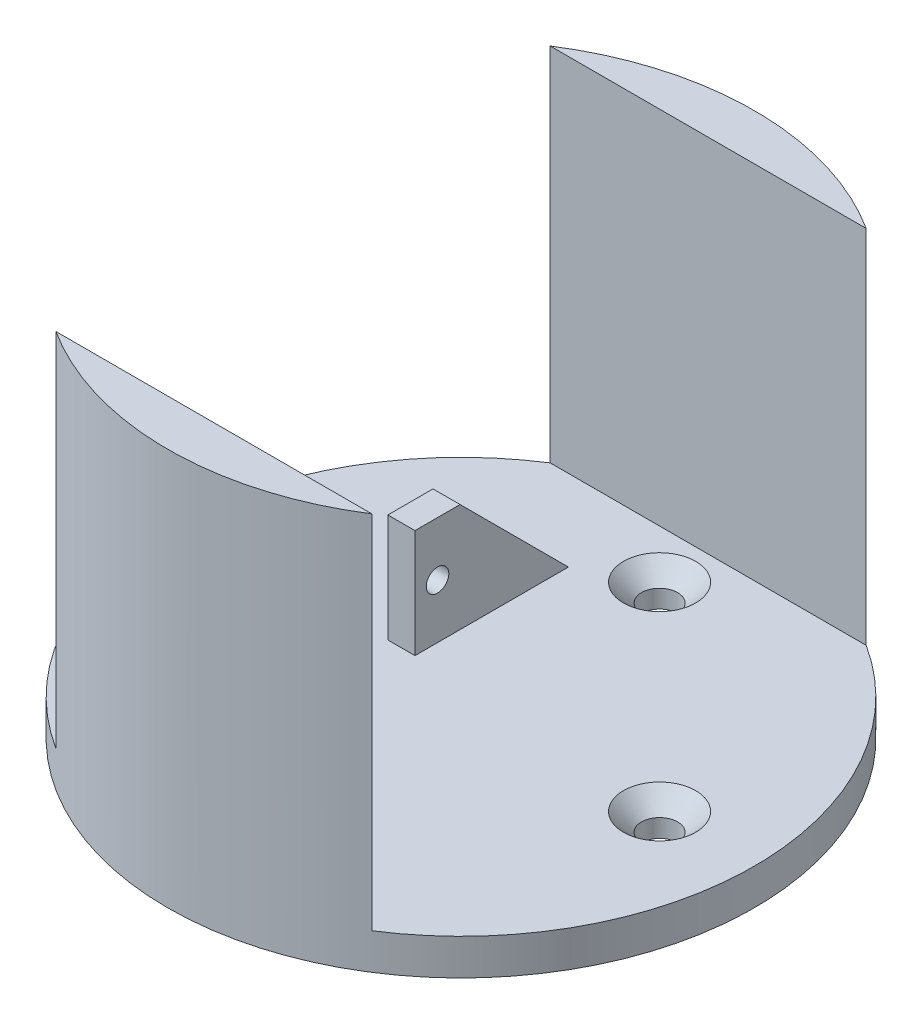
ISO-10303-21;
HEADER;
FILE_DESCRIPTION(('STEP AP214'),'2;1');
FILE_NAME('part.step','',(''),(''),'','','');
FILE_SCHEMA(('AUTOMOTIVE_DESIGN { 1 0 10303 214 1 1 1 1 }'));
ENDSEC;
DATA;
#1=APPLICATION_CONTEXT('core data for automotive mechanical design processes');
#2=APPLICATION_PROTOCOL_DEFINITION('international standard','automotive_design',2000,#1);
#3=PRODUCT_CONTEXT('',#1,'mechanical');
#4=PRODUCT('Part','Part','',(#3));
#5=PRODUCT_RELATED_PRODUCT_CATEGORY('part','',(#4));
#6=PRODUCT_DEFINITION_FORMATION('','',#4);
#7=PRODUCT_DEFINITION_CONTEXT('part definition',#1,'design');
#8=PRODUCT_DEFINITION('design','',#6,#7);
#9=PRODUCT_DEFINITION_SHAPE('','',#8);
#10=(LENGTH_UNIT() NAMED_UNIT(*) SI_UNIT(.MILLI.,.METRE.));
#11=(NAMED_UNIT(*) PLANE_ANGLE_UNIT() SI_UNIT($,.RADIAN.));
#12=(NAMED_UNIT(*) SI_UNIT($,.STERADIAN.) SOLID_ANGLE_UNIT());
#13=UNCERTAINTY_MEASURE_WITH_UNIT(LENGTH_MEASURE(1.E-05),#10,'distance_accuracy_value','');
#14=(GEOMETRIC_REPRESENTATION_CONTEXT(3) GLOBAL_UNCERTAINTY_ASSIGNED_CONTEXT((#13)) GLOBAL_UNIT_ASSIGNED_CONTEXT((#10,
#11,#12)) REPRESENTATION_CONTEXT('',''));
#15=CARTESIAN_POINT('',(0.,0.,0.));
#16=DIRECTION('',(0.,0.,1.));
#17=DIRECTION('',(1.,0.,0.));
#18=AXIS2_PLACEMENT_3D('',#15,#16,#17);
#19=CARTESIAN_POINT('',(0.,4.,0.));
#20=DIRECTION('',(0.,1.,0.));
#21=DIRECTION('',(0.,0.,1.));
#22=AXIS2_PLACEMENT_3D('',#19,#20,#21);
#23=PLANE('',#22);
#24=CARTESIAN_POINT('',(-28.95,4.,-1.9));
#25=DIRECTION('',(0.,1.,0.));
#26=DIRECTION('',(0.,0.,-1.));
#27=AXIS2_PLACEMENT_3D('',#24,#25,#26);
#28=CIRCLE('',#27,2.);
#29=CARTESIAN_POINT('',(-26.95,4.,-1.9));
#30=VERTEX_POINT('',#29);
#31=CARTESIAN_POINT('',(-30.95,4.,-1.9));
#32=VERTEX_POINT('',#31);
#33=EDGE_CURVE('E160',#30,#32,#28,.T.);
#34=ORIENTED_EDGE('',*,*,#33,.F.);
#35=DIRECTION('',(0.,0.,-1.));
#36=VECTOR('',#35,1.);
#37=CARTESIAN_POINT('',(-26.95,4.,-1.9));
#38=LINE('',#37,#36);
#39=CARTESIAN_POINT('',(-26.95,4.,3.1));
#40=VERTEX_POINT('',#39);
#41=EDGE_CURVE('E177',#40,#30,#38,.T.);
#42=ORIENTED_EDGE('',*,*,#41,.F.);
#43=CARTESIAN_POINT('',(-28.95,4.,3.1));
#44=DIRECTION('',(0.,1.,0.));
#45=DIRECTION('',(0.,0.,1.));
#46=AXIS2_PLACEMENT_3D('',#43,#44,#45);
#47=CIRCLE('',#46,2.);
#48=CARTESIAN_POINT('',(-30.95,4.,3.1));
#49=VERTEX_POINT('',#48);
#50=EDGE_CURVE('E180',#49,#40,#47,.T.);
#51=ORIENTED_EDGE('',*,*,#50,.F.);
#52=DIRECTION('',(0.,0.,1.));
#53=VECTOR('',#52,1.);
#54=CARTESIAN_POINT('',(-30.95,4.,-1.9));
#55=LINE('',#54,#53);
#56=EDGE_CURVE('E186',#32,#49,#55,.T.);
#57=ORIENTED_EDGE('',*,*,#56,.F.);
#58=EDGE_LOOP('',(#34,#42,#51,#57));
#59=FACE_BOUND('',#58,.T.);
#60=CARTESIAN_POINT('',(-2.30437768363647E-13,4.,22.));
#61=DIRECTION('',(0.,1.,0.));
#62=DIRECTION('',(0.,0.,1.));
#63=AXIS2_PLACEMENT_3D('',#60,#61,#62);
#64=CIRCLE('',#63,4.00000000000003);
#65=CARTESIAN_POINT('',(-2.30437768363647E-13,4.,26.));
#66=VERTEX_POINT('',#65);
#67=EDGE_CURVE('E309',#66,#66,#64,.F.);
#68=ORIENTED_EDGE('',*,*,#67,.T.);
#69=EDGE_LOOP('',(#68));
#70=FACE_BOUND('',#69,.T.);
#71=CARTESIAN_POINT('',(0.,4.,-22.));
#72=DIRECTION('',(0.,1.,0.));
#73=DIRECTION('',(0.,0.,1.));
#74=AXIS2_PLACEMENT_3D('',#71,#72,#73);
#75=CIRCLE('',#74,4.00000000000003);
#76=CARTESIAN_POINT('',(0.,4.,-18.));
#77=VERTEX_POINT('',#76);
#78=EDGE_CURVE('E306',#77,#77,#75,.F.);
#79=ORIENTED_EDGE('',*,*,#78,.T.);
#80=EDGE_LOOP('',(#79));
#81=FACE_BOUND('',#80,.T.);
#82=CARTESIAN_POINT('',(22.,4.,1.53625178909098E-13));
#83=DIRECTION('',(0.,1.,0.));
#84=DIRECTION('',(0.,0.,1.));
#85=AXIS2_PLACEMENT_3D('',#82,#83,#84);
#86=CIRCLE('',#85,4.00000000000003);
#87=CARTESIAN_POINT('',(22.,4.,4.00000000000018));
#88=VERTEX_POINT('',#87);
#89=EDGE_CURVE('E303',#88,#88,#86,.F.);
#90=ORIENTED_EDGE('',*,*,#89,.T.);
#91=EDGE_LOOP('',(#90));
#92=FACE_BOUND('',#91,.T.);
#93=CARTESIAN_POINT('',(-22.,4.,0.));
#94=DIRECTION('',(0.,1.,0.));
#95=DIRECTION('',(0.,0.,1.));
#96=AXIS2_PLACEMENT_3D('',#93,#94,#95);
#97=CIRCLE('',#96,4.00000000000003);
#98=CARTESIAN_POINT('',(-22.,4.,4.00000000000003));
#99=VERTEX_POINT('',#98);
#100=EDGE_CURVE('E300',#99,#99,#97,.F.);
#101=ORIENTED_EDGE('',*,*,#100,.T.);
#102=EDGE_LOOP('',(#101));
#103=FACE_BOUND('',#102,.T.);
#104=DIRECTION('',(0.,0.,-1.));
#105=VECTOR('',#104,1.);
#106=CARTESIAN_POINT('',(-6.50000000000001,4.,26.4));
#107=LINE('',#106,#105);
#108=CARTESIAN_POINT('',(-6.50000000000001,4.,27.3861278752583));
#109=VERTEX_POINT('',#108);
#110=CARTESIAN_POINT('',(-6.50000000000001,4.,21.4));
#111=VERTEX_POINT('',#110);
#112=EDGE_CURVE('E48',#109,#111,#107,.T.);
#113=ORIENTED_EDGE('',*,*,#112,.F.);
#114=DIRECTION('',(-1.,0.,0.));
#115=VECTOR('',#114,1.);
#116=CARTESIAN_POINT('',(17.5,4.,27.3861278752583));
#117=LINE('',#116,#115);
#118=CARTESIAN_POINT('',(17.5,4.,27.3861278752583));
#119=VERTEX_POINT('',#118);
#120=EDGE_CURVE('E254',#119,#109,#117,.T.);
#121=ORIENTED_EDGE('',*,*,#120,.F.);
#122=CARTESIAN_POINT('',(0.,4.,0.));
#123=DIRECTION('',(0.,1.,0.));
#124=DIRECTION('',(0.,0.,1.));
#125=AXIS2_PLACEMENT_3D('',#122,#123,#124);
#126=CIRCLE('',#125,32.5);
#127=CARTESIAN_POINT('',(17.5,4.,-27.3861278752583));
#128=VERTEX_POINT('',#127);
#129=EDGE_CURVE('E295',#119,#128,#126,.T.);
#130=ORIENTED_EDGE('',*,*,#129,.T.);
#131=DIRECTION('',(1.,0.,0.));
#132=VECTOR('',#131,1.);
#133=CARTESIAN_POINT('',(17.5,4.,-27.3861278752583));
#134=LINE('',#133,#132);
#135=CARTESIAN_POINT('',(-17.5,4.,-27.3861278752583));
#136=VERTEX_POINT('',#135);
#137=EDGE_CURVE('E264',#136,#128,#134,.T.);
#138=ORIENTED_EDGE('',*,*,#137,.F.);
#139=CARTESIAN_POINT('',(-17.5,4.,27.3861278752583));
#140=VERTEX_POINT('',#139);
#141=EDGE_CURVE('E291',#136,#140,#126,.T.);
#142=ORIENTED_EDGE('',*,*,#141,.T.);
#143=CARTESIAN_POINT('',(-9.50000000000001,4.,27.3861278752583));
#144=VERTEX_POINT('',#143);
#145=EDGE_CURVE('E249',#144,#140,#117,.T.);
#146=ORIENTED_EDGE('',*,*,#145,.F.);
#147=DIRECTION('',(0.,0.,1.));
#148=VECTOR('',#147,1.);
#149=CARTESIAN_POINT('',(-9.50000000000001,4.,26.4));
#150=LINE('',#149,#148);
#151=CARTESIAN_POINT('',(-9.50000000000001,4.,21.4));
#152=VERTEX_POINT('',#151);
#153=EDGE_CURVE('E207',#152,#144,#150,.T.);
#154=ORIENTED_EDGE('',*,*,#153,.F.);
#155=DIRECTION('',(-1.,0.,0.));
#156=VECTOR('',#155,1.);
#157=CARTESIAN_POINT('',(-6.50000000000001,4.,21.4));
#158=LINE('',#157,#156);
#159=EDGE_CURVE('E212',#111,#152,#158,.T.);
#160=ORIENTED_EDGE('',*,*,#159,.F.);
#161=EDGE_LOOP('',(#113,#121,#130,#138,#142,#146,#154,#160));
#162=FACE_BOUND('',#161,.T.);
#163=DIRECTION('',(0.,0.,1.));
#164=VECTOR('',#163,1.);
#165=CARTESIAN_POINT('',(-9.5,4.,-6.4));
#166=LINE('',#165,#164);
#167=CARTESIAN_POINT('',(-9.5,4.,-18.3999999999999));
#168=VERTEX_POINT('',#167);
#169=CARTESIAN_POINT('',(-9.5,4.,-1.4));
#170=VERTEX_POINT('',#169);
#171=EDGE_CURVE('E241',#168,#170,#166,.T.);
#172=ORIENTED_EDGE('',*,*,#171,.F.);
#173=DIRECTION('',(1.,0.,0.));
#174=VECTOR('',#173,1.);
#175=CARTESIAN_POINT('',(0.,4.,-18.3999999999999));
#176=LINE('',#175,#174);
#177=CARTESIAN_POINT('',(-6.5,4.,-18.3999999999999));
#178=VERTEX_POINT('',#177);
#179=EDGE_CURVE('E321',#168,#178,#176,.T.);
#180=ORIENTED_EDGE('',*,*,#179,.T.);
#181=DIRECTION('',(0.,0.,-1.));
#182=VECTOR('',#181,1.);
#183=CARTESIAN_POINT('',(-6.5,4.,-6.4));
#184=LINE('',#183,#182);
#185=CARTESIAN_POINT('',(-6.5,4.,-1.4));
#186=VERTEX_POINT('',#185);
#187=EDGE_CURVE('E227',#186,#178,#184,.T.);
#188=ORIENTED_EDGE('',*,*,#187,.F.);
#189=DIRECTION('',(1.,0.,0.));
#190=VECTOR('',#189,1.);
#191=CARTESIAN_POINT('',(-9.5,4.,-1.4));
#192=LINE('',#191,#190);
#193=EDGE_CURVE('E232',#170,#186,#192,.T.);
#194=ORIENTED_EDGE('',*,*,#193,.F.);
#195=EDGE_LOOP('',(#172,#180,#188,#194));
#196=FACE_BOUND('',#195,.T.);
#197=ADVANCED_FACE('F33',(#59,#70,#81,#92,#103,#162,#196),#23,.T.);
#198=CARTESIAN_POINT('',(0.,0.,0.));
#199=DIRECTION('',(0.,1.,0.));
#200=DIRECTION('',(0.,0.,1.));
#201=AXIS2_PLACEMENT_3D('',#198,#199,#200);
#202=PLANE('',#201);
#203=CARTESIAN_POINT('',(0.,0.,0.));
#204=DIRECTION('',(0.,1.,0.));
#205=DIRECTION('',(0.,0.,1.));
#206=AXIS2_PLACEMENT_3D('',#203,#204,#205);
#207=CIRCLE('',#206,32.5);
#208=CARTESIAN_POINT('',(0.,0.,32.5));
#209=VERTEX_POINT('',#208);
#210=EDGE_CURVE('E290',#209,#209,#207,.T.);
#211=ORIENTED_EDGE('',*,*,#210,.F.);
#212=EDGE_LOOP('',(#211));
#213=FACE_BOUND('',#212,.T.);
#214=CARTESIAN_POINT('',(-22.,0.,0.));
#215=DIRECTION('',(0.,1.,0.));
#216=DIRECTION('',(0.,0.,1.));
#217=AXIS2_PLACEMENT_3D('',#214,#215,#216);
#218=CIRCLE('',#217,2.);
#219=CARTESIAN_POINT('',(-22.,0.,2.));
#220=VERTEX_POINT('',#219);
#221=EDGE_CURVE('E287',#220,#220,#218,.T.);
#222=ORIENTED_EDGE('',*,*,#221,.T.);
#223=EDGE_LOOP('',(#222));
#224=FACE_BOUND('',#223,.T.);
#225=CARTESIAN_POINT('',(0.,0.,-22.));
#226=DIRECTION('',(0.,1.,0.));
#227=DIRECTION('',(0.,0.,1.));
#228=AXIS2_PLACEMENT_3D('',#225,#226,#227);
#229=CIRCLE('',#228,2.);
#230=CARTESIAN_POINT('',(0.,0.,-20.));
#231=VERTEX_POINT('',#230);
#232=EDGE_CURVE('E284',#231,#231,#229,.T.);
#233=ORIENTED_EDGE('',*,*,#232,.T.);
#234=EDGE_LOOP('',(#233));
#235=FACE_BOUND('',#234,.T.);
#236=CARTESIAN_POINT('',(22.,0.,1.53625178909098E-13));
#237=DIRECTION('',(0.,1.,0.));
#238=DIRECTION('',(0.,0.,1.));
#239=AXIS2_PLACEMENT_3D('',#236,#237,#238);
#240=CIRCLE('',#239,2.);
#241=CARTESIAN_POINT('',(22.,0.,2.00000000000016));
#242=VERTEX_POINT('',#241);
#243=EDGE_CURVE('E281',#242,#242,#240,.T.);
#244=ORIENTED_EDGE('',*,*,#243,.T.);
#245=EDGE_LOOP('',(#244));
#246=FACE_BOUND('',#245,.T.);
#247=CARTESIAN_POINT('',(-2.30437768363647E-13,0.,22.));
#248=DIRECTION('',(0.,1.,0.));
#249=DIRECTION('',(0.,0.,1.));
#250=AXIS2_PLACEMENT_3D('',#247,#248,#249);
#251=CIRCLE('',#250,2.);
#252=CARTESIAN_POINT('',(-2.30437768363647E-13,0.,24.));
#253=VERTEX_POINT('',#252);
#254=EDGE_CURVE('E278',#253,#253,#251,.T.);
#255=ORIENTED_EDGE('',*,*,#254,.T.);
#256=EDGE_LOOP('',(#255));
#257=FACE_BOUND('',#256,.T.);
#258=ADVANCED_FACE('F378',(#213,#224,#235,#246,#257),#202,.F.);
#259=CARTESIAN_POINT('',(0.,4.,0.));
#260=DIRECTION('',(0.,-1.,0.));
#261=DIRECTION('',(0.,0.,-1.));
#262=AXIS2_PLACEMENT_3D('',#259,#260,#261);
#263=CYLINDRICAL_SURFACE('',#262,32.5);
#264=ORIENTED_EDGE('',*,*,#141,.F.);
#265=DIRECTION('',(0.,-1.,0.));
#266=VECTOR('',#265,1.);
#267=CARTESIAN_POINT('',(-17.5,44.,-27.3861278752583));
#268=LINE('',#267,#266);
#269=CARTESIAN_POINT('',(-17.5,44.,-27.3861278752583));
#270=VERTEX_POINT('',#269);
#271=EDGE_CURVE('E275',#270,#136,#268,.T.);
#272=ORIENTED_EDGE('',*,*,#271,.F.);
#273=CARTESIAN_POINT('',(0.,44.,0.));
#274=DIRECTION('',(0.,1.,0.));
#275=DIRECTION('',(0.,0.,1.));
#276=AXIS2_PLACEMENT_3D('',#273,#274,#275);
#277=CIRCLE('',#276,32.5);
#278=CARTESIAN_POINT('',(17.5,44.,-27.3861278752583));
#279=VERTEX_POINT('',#278);
#280=EDGE_CURVE('E265',#279,#270,#277,.T.);
#281=ORIENTED_EDGE('',*,*,#280,.F.);
#282=DIRECTION('',(0.,-1.,0.));
#283=VECTOR('',#282,1.);
#284=CARTESIAN_POINT('',(17.5,44.,-27.3861278752583));
#285=LINE('',#284,#283);
#286=EDGE_CURVE('E270',#279,#128,#285,.T.);
#287=ORIENTED_EDGE('',*,*,#286,.T.);
#288=ORIENTED_EDGE('',*,*,#129,.F.);
#289=DIRECTION('',(0.,-1.,0.));
#290=VECTOR('',#289,1.);
#291=CARTESIAN_POINT('',(17.5,44.,27.3861278752583));
#292=LINE('',#291,#290);
#293=CARTESIAN_POINT('',(17.5,44.,27.3861278752583));
#294=VERTEX_POINT('',#293);
#295=EDGE_CURVE('E261',#294,#119,#292,.T.);
#296=ORIENTED_EDGE('',*,*,#295,.F.);
#297=CARTESIAN_POINT('',(0.,44.,0.));
#298=DIRECTION('',(0.,1.,0.));
#299=DIRECTION('',(0.,0.,-1.));
#300=AXIS2_PLACEMENT_3D('',#297,#298,#299);
#301=CIRCLE('',#300,32.5);
#302=CARTESIAN_POINT('',(-17.5,44.,27.3861278752583));
#303=VERTEX_POINT('',#302);
#304=EDGE_CURVE('E250',#303,#294,#301,.T.);
#305=ORIENTED_EDGE('',*,*,#304,.F.);
#306=DIRECTION('',(0.,-1.,0.));
#307=VECTOR('',#306,1.);
#308=CARTESIAN_POINT('',(-17.5,44.,27.3861278752583));
#309=LINE('',#308,#307);
#310=EDGE_CURVE('E256',#303,#140,#309,.T.);
#311=ORIENTED_EDGE('',*,*,#310,.T.);
#312=EDGE_LOOP('',(#264,#272,#281,#287,#288,#296,#305,#311));
#313=FACE_BOUND('',#312,.T.);
#314=ORIENTED_EDGE('',*,*,#210,.T.);
#315=EDGE_LOOP('',(#314));
#316=FACE_BOUND('',#315,.T.);
#317=ADVANCED_FACE('F360',(#313,#316),#263,.T.);
#318=CARTESIAN_POINT('',(-22.,4.,0.));
#319=DIRECTION('',(0.,-1.,0.));
#320=DIRECTION('',(0.,0.,-1.));
#321=AXIS2_PLACEMENT_3D('',#318,#319,#320);
#322=CYLINDRICAL_SURFACE('',#321,2.);
#323=CARTESIAN_POINT('',(-22.,1.99999999999998,0.));
#324=DIRECTION('',(0.,1.,0.));
#325=DIRECTION('',(0.,0.,1.));
#326=AXIS2_PLACEMENT_3D('',#323,#324,#325);
#327=CIRCLE('',#326,2.);
#328=CARTESIAN_POINT('',(-22.,1.99999999999998,2.));
#329=VERTEX_POINT('',#328);
#330=EDGE_CURVE('E318',#329,#329,#327,.T.);
#331=ORIENTED_EDGE('',*,*,#330,.T.);
#332=EDGE_LOOP('',(#331));
#333=FACE_BOUND('',#332,.T.);
#334=ORIENTED_EDGE('',*,*,#221,.F.);
#335=EDGE_LOOP('',(#334));
#336=FACE_BOUND('',#335,.T.);
#337=ADVANCED_FACE('F390',(#333,#336),#322,.F.);
#338=CARTESIAN_POINT('',(0.,4.,-22.));
#339=DIRECTION('',(0.,-1.,0.));
#340=DIRECTION('',(0.,0.,-1.));
#341=AXIS2_PLACEMENT_3D('',#338,#339,#340);
#342=CYLINDRICAL_SURFACE('',#341,2.);
#343=CARTESIAN_POINT('',(0.,1.99999999999998,-22.));
#344=DIRECTION('',(0.,1.,0.));
#345=DIRECTION('',(0.,0.,1.));
#346=AXIS2_PLACEMENT_3D('',#343,#344,#345);
#347=CIRCLE('',#346,2.);
#348=CARTESIAN_POINT('',(0.,1.99999999999998,-20.));
#349=VERTEX_POINT('',#348);
#350=EDGE_CURVE('E312',#349,#349,#347,.T.);
#351=ORIENTED_EDGE('',*,*,#350,.T.);
#352=EDGE_LOOP('',(#351));
#353=FACE_BOUND('',#352,.T.);
#354=ORIENTED_EDGE('',*,*,#232,.F.);
#355=EDGE_LOOP('',(#354));
#356=FACE_BOUND('',#355,.T.);
#357=ADVANCED_FACE('F592',(#353,#356),#342,.F.);
#358=CARTESIAN_POINT('',(22.,4.,1.53625178909098E-13));
#359=DIRECTION('',(0.,-1.,0.));
#360=DIRECTION('',(0.,0.,-1.));
#361=AXIS2_PLACEMENT_3D('',#358,#359,#360);
#362=CYLINDRICAL_SURFACE('',#361,2.);
#363=CARTESIAN_POINT('',(22.,1.99999999999998,1.53625178909098E-13));
#364=DIRECTION('',(0.,1.,0.));
#365=DIRECTION('',(0.,0.,1.));
#366=AXIS2_PLACEMENT_3D('',#363,#364,#365);
#367=CIRCLE('',#366,2.);
#368=CARTESIAN_POINT('',(22.,1.99999999999998,2.00000000000016));
#369=VERTEX_POINT('',#368);
#370=EDGE_CURVE('E315',#369,#369,#367,.T.);
#371=ORIENTED_EDGE('',*,*,#370,.T.);
#372=EDGE_LOOP('',(#371));
#373=FACE_BOUND('',#372,.T.);
#374=ORIENTED_EDGE('',*,*,#243,.F.);
#375=EDGE_LOOP('',(#374));
#376=FACE_BOUND('',#375,.T.);
#377=ADVANCED_FACE('F580',(#373,#376),#362,.F.);
#378=CARTESIAN_POINT('',(-2.30437768363647E-13,4.,22.));
#379=DIRECTION('',(0.,-1.,0.));
#380=DIRECTION('',(0.,0.,-1.));
#381=AXIS2_PLACEMENT_3D('',#378,#379,#380);
#382=CYLINDRICAL_SURFACE('',#381,2.);
#383=CARTESIAN_POINT('',(-2.30437768363647E-13,1.99999999999998,22.));
#384=DIRECTION('',(0.,1.,0.));
#385=DIRECTION('',(0.,0.,1.));
#386=AXIS2_PLACEMENT_3D('',#383,#384,#385);
#387=CIRCLE('',#386,2.);
#388=CARTESIAN_POINT('',(-2.30437768363647E-13,1.99999999999998,24.));
#389=VERTEX_POINT('',#388);
#390=EDGE_CURVE('E294',#389,#389,#387,.T.);
#391=ORIENTED_EDGE('',*,*,#390,.T.);
#392=EDGE_LOOP('',(#391));
#393=FACE_BOUND('',#392,.T.);
#394=ORIENTED_EDGE('',*,*,#254,.F.);
#395=EDGE_LOOP('',(#394));
#396=FACE_BOUND('',#395,.T.);
#397=ADVANCED_FACE('F560',(#393,#396),#382,.F.);
#398=CARTESIAN_POINT('',(17.5,44.,-27.3861278752583));
#399=DIRECTION('',(0.,0.,-1.));
#400=DIRECTION('',(-1.,0.,0.));
#401=AXIS2_PLACEMENT_3D('',#398,#399,#400);
#402=PLANE('',#401);
#403=ORIENTED_EDGE('',*,*,#137,.T.);
#404=ORIENTED_EDGE('',*,*,#286,.F.);
#405=DIRECTION('',(1.,0.,0.));
#406=VECTOR('',#405,1.);
#407=CARTESIAN_POINT('',(17.5,44.,-27.3861278752583));
#408=LINE('',#407,#406);
#409=EDGE_CURVE('E268',#270,#279,#408,.T.);
#410=ORIENTED_EDGE('',*,*,#409,.F.);
#411=ORIENTED_EDGE('',*,*,#271,.T.);
#412=EDGE_LOOP('',(#403,#404,#410,#411));
#413=FACE_BOUND('',#412,.T.);
#414=ADVANCED_FACE('F554',(#413),#402,.F.);
#415=CARTESIAN_POINT('',(0.,44.,0.));
#416=DIRECTION('',(0.,1.,0.));
#417=DIRECTION('',(0.,0.,1.));
#418=AXIS2_PLACEMENT_3D('',#415,#416,#417);
#419=PLANE('',#418);
#420=ORIENTED_EDGE('',*,*,#280,.T.);
#421=ORIENTED_EDGE('',*,*,#409,.T.);
#422=EDGE_LOOP('',(#420,#421));
#423=FACE_BOUND('',#422,.T.);
#424=ADVANCED_FACE('F374',(#423),#419,.T.);
#425=CARTESIAN_POINT('',(17.5,44.,27.3861278752583));
#426=DIRECTION('',(0.,0.,1.));
#427=DIRECTION('',(1.,0.,0.));
#428=AXIS2_PLACEMENT_3D('',#425,#426,#427);
#429=PLANE('',#428);
#430=ORIENTED_EDGE('',*,*,#120,.T.);
#431=DIRECTION('',(0.,1.,0.));
#432=VECTOR('',#431,1.);
#433=CARTESIAN_POINT('',(-6.50000000000001,16.,27.3861278752583));
#434=LINE('',#433,#432);
#435=CARTESIAN_POINT('',(-6.50000000000001,15.0138721247419,27.3861278752583));
#436=VERTEX_POINT('',#435);
#437=EDGE_CURVE('E327',#109,#436,#434,.T.);
#438=ORIENTED_EDGE('',*,*,#437,.T.);
#439=DIRECTION('',(-1.,0.,0.));
#440=VECTOR('',#439,1.);
#441=CARTESIAN_POINT('',(-6.50000000000001,15.0138721247419,27.3861278752583));
#442=LINE('',#441,#440);
#443=CARTESIAN_POINT('',(-9.50000000000001,15.0138721247419,27.3861278752583));
#444=VERTEX_POINT('',#443);
#445=EDGE_CURVE('E324',#436,#444,#442,.T.);
#446=ORIENTED_EDGE('',*,*,#445,.T.);
#447=DIRECTION('',(0.,-1.,0.));
#448=VECTOR('',#447,1.);
#449=CARTESIAN_POINT('',(-9.50000000000001,16.,27.3861278752583));
#450=LINE('',#449,#448);
#451=EDGE_CURVE('E55',#444,#144,#450,.T.);
#452=ORIENTED_EDGE('',*,*,#451,.T.);
#453=ORIENTED_EDGE('',*,*,#145,.T.);
#454=ORIENTED_EDGE('',*,*,#310,.F.);
#455=DIRECTION('',(-1.,0.,0.));
#456=VECTOR('',#455,1.);
#457=CARTESIAN_POINT('',(17.5,44.,27.3861278752583));
#458=LINE('',#457,#456);
#459=EDGE_CURVE('E253',#294,#303,#458,.T.);
#460=ORIENTED_EDGE('',*,*,#459,.F.);
#461=ORIENTED_EDGE('',*,*,#295,.T.);
#462=EDGE_LOOP('',(#430,#438,#446,#452,#453,#454,#460,#461));
#463=FACE_BOUND('',#462,.T.);
#464=ADVANCED_FACE('F342',(#463),#429,.F.);
#465=CARTESIAN_POINT('',(0.,44.,0.));
#466=DIRECTION('',(0.,-1.,0.));
#467=DIRECTION('',(0.,0.,-1.));
#468=AXIS2_PLACEMENT_3D('',#465,#466,#467);
#469=PLANE('',#468);
#470=ORIENTED_EDGE('',*,*,#304,.T.);
#471=ORIENTED_EDGE('',*,*,#459,.T.);
#472=EDGE_LOOP('',(#470,#471));
#473=FACE_BOUND('',#472,.T.);
#474=ADVANCED_FACE('F363',(#473),#469,.F.);
#475=CARTESIAN_POINT('',(-2.30437768363647E-13,1.99999999999998,22.));
#476=DIRECTION('',(0.,1.,0.));
#477=DIRECTION('',(0.,0.,1.));
#478=AXIS2_PLACEMENT_3D('',#475,#476,#477);
#479=CONICAL_SURFACE('',#478,2.,0.785398163397449);
#480=ORIENTED_EDGE('',*,*,#67,.F.);
#481=EDGE_LOOP('',(#480));
#482=FACE_BOUND('',#481,.T.);
#483=ORIENTED_EDGE('',*,*,#390,.F.);
#484=EDGE_LOOP('',(#483));
#485=FACE_BOUND('',#484,.T.);
#486=ADVANCED_FACE('F365',(#482,#485),#479,.F.);
#487=CARTESIAN_POINT('',(0.,1.99999999999998,-22.));
#488=DIRECTION('',(0.,1.,0.));
#489=DIRECTION('',(0.,0.,1.));
#490=AXIS2_PLACEMENT_3D('',#487,#488,#489);
#491=CONICAL_SURFACE('',#490,2.,0.78539816339745);
#492=ORIENTED_EDGE('',*,*,#78,.F.);
#493=EDGE_LOOP('',(#492));
#494=FACE_BOUND('',#493,.T.);
#495=ORIENTED_EDGE('',*,*,#350,.F.);
#496=EDGE_LOOP('',(#495));
#497=FACE_BOUND('',#496,.T.);
#498=ADVANCED_FACE('F371',(#494,#497),#491,.F.);
#499=CARTESIAN_POINT('',(22.,1.99999999999998,1.53625178909098E-13));
#500=DIRECTION('',(0.,1.,0.));
#501=DIRECTION('',(0.,0.,1.));
#502=AXIS2_PLACEMENT_3D('',#499,#500,#501);
#503=CONICAL_SURFACE('',#502,2.,0.78539816339745);
#504=ORIENTED_EDGE('',*,*,#89,.F.);
#505=EDGE_LOOP('',(#504));
#506=FACE_BOUND('',#505,.T.);
#507=ORIENTED_EDGE('',*,*,#370,.F.);
#508=EDGE_LOOP('',(#507));
#509=FACE_BOUND('',#508,.T.);
#510=ADVANCED_FACE('F397',(#506,#509),#503,.F.);
#511=CARTESIAN_POINT('',(-22.,1.99999999999998,0.));
#512=DIRECTION('',(0.,1.,0.));
#513=DIRECTION('',(0.,0.,1.));
#514=AXIS2_PLACEMENT_3D('',#511,#512,#513);
#515=CONICAL_SURFACE('',#514,2.,0.78539816339745);
#516=ORIENTED_EDGE('',*,*,#100,.F.);
#517=EDGE_LOOP('',(#516));
#518=FACE_BOUND('',#517,.T.);
#519=ORIENTED_EDGE('',*,*,#330,.F.);
#520=EDGE_LOOP('',(#519));
#521=FACE_BOUND('',#520,.T.);
#522=ADVANCED_FACE('F401',(#518,#521),#515,.F.);
#523=CARTESIAN_POINT('',(-6.5,16.,-6.4));
#524=DIRECTION('',(-1.,0.,0.));
#525=DIRECTION('',(0.,0.,1.));
#526=AXIS2_PLACEMENT_3D('',#523,#524,#525);
#527=PLANE('',#526);
#528=CARTESIAN_POINT('',(-6.5,10.,-3.9));
#529=DIRECTION('',(-1.,0.,0.));
#530=DIRECTION('',(0.,0.,1.));
#531=AXIS2_PLACEMENT_3D('',#528,#529,#530);
#532=CIRCLE('',#531,1.25);
#533=CARTESIAN_POINT('',(-6.5,10.,-2.65));
#534=VERTEX_POINT('',#533);
#535=EDGE_CURVE('E204',#534,#534,#532,.F.);
#536=ORIENTED_EDGE('',*,*,#535,.F.);
#537=EDGE_LOOP('',(#536));
#538=FACE_BOUND('',#537,.T.);
#539=ORIENTED_EDGE('',*,*,#187,.T.);
#540=DIRECTION('',(0.,0.707106781186552,0.707106781186543));
#541=VECTOR('',#540,1.);
#542=CARTESIAN_POINT('',(-6.5,16.,-6.40000000000004));
#543=LINE('',#542,#541);
#544=CARTESIAN_POINT('',(-6.5,16.,-6.4));
#545=VERTEX_POINT('',#544);
#546=EDGE_CURVE('E333',#178,#545,#543,.T.);
#547=ORIENTED_EDGE('',*,*,#546,.T.);
#548=DIRECTION('',(0.,0.,-1.));
#549=VECTOR('',#548,1.);
#550=CARTESIAN_POINT('',(-6.5,16.,-6.4));
#551=LINE('',#550,#549);
#552=CARTESIAN_POINT('',(-6.5,16.,-1.4));
#553=VERTEX_POINT('',#552);
#554=EDGE_CURVE('E228',#553,#545,#551,.T.);
#555=ORIENTED_EDGE('',*,*,#554,.F.);
#556=DIRECTION('',(0.,-1.,0.));
#557=VECTOR('',#556,1.);
#558=CARTESIAN_POINT('',(-6.5,16.,-1.4));
#559=LINE('',#558,#557);
#560=EDGE_CURVE('E239',#553,#186,#559,.T.);
#561=ORIENTED_EDGE('',*,*,#560,.T.);
#562=EDGE_LOOP('',(#539,#547,#555,#561));
#563=FACE_BOUND('',#562,.T.);
#564=ADVANCED_FACE('F404',(#538,#563),#527,.F.);
#565=CARTESIAN_POINT('',(-9.5,16.,-6.4));
#566=DIRECTION('',(1.,0.,0.));
#567=DIRECTION('',(0.,0.,-1.));
#568=AXIS2_PLACEMENT_3D('',#565,#566,#567);
#569=PLANE('',#568);
#570=CARTESIAN_POINT('',(-9.5,10.,-3.9));
#571=DIRECTION('',(-1.,0.,0.));
#572=DIRECTION('',(0.,0.,1.));
#573=AXIS2_PLACEMENT_3D('',#570,#571,#572);
#574=CIRCLE('',#573,1.25);
#575=CARTESIAN_POINT('',(-9.5,10.,-2.65));
#576=VERTEX_POINT('',#575);
#577=EDGE_CURVE('E201',#576,#576,#574,.T.);
#578=ORIENTED_EDGE('',*,*,#577,.F.);
#579=EDGE_LOOP('',(#578));
#580=FACE_BOUND('',#579,.T.);
#581=ORIENTED_EDGE('',*,*,#171,.T.);
#582=DIRECTION('',(0.,-1.,0.));
#583=VECTOR('',#582,1.);
#584=CARTESIAN_POINT('',(-9.5,16.,-1.4));
#585=LINE('',#584,#583);
#586=CARTESIAN_POINT('',(-9.5,16.,-1.4));
#587=VERTEX_POINT('',#586);
#588=EDGE_CURVE('E247',#587,#170,#585,.T.);
#589=ORIENTED_EDGE('',*,*,#588,.F.);
#590=DIRECTION('',(0.,0.,1.));
#591=VECTOR('',#590,1.);
#592=CARTESIAN_POINT('',(-9.5,16.,-6.4));
#593=LINE('',#592,#591);
#594=CARTESIAN_POINT('',(-9.5,16.,-6.4));
#595=VERTEX_POINT('',#594);
#596=EDGE_CURVE('E235',#595,#587,#593,.T.);
#597=ORIENTED_EDGE('',*,*,#596,.F.);
#598=DIRECTION('',(0.,-0.707106781186552,-0.707106781186543));
#599=VECTOR('',#598,1.);
#600=CARTESIAN_POINT('',(-9.5,16.,-6.40000000000004));
#601=LINE('',#600,#599);
#602=EDGE_CURVE('E330',#595,#168,#601,.T.);
#603=ORIENTED_EDGE('',*,*,#602,.T.);
#604=EDGE_LOOP('',(#581,#589,#597,#603));
#605=FACE_BOUND('',#604,.T.);
#606=ADVANCED_FACE('F430',(#580,#605),#569,.F.);
#607=CARTESIAN_POINT('',(-9.5,16.,-1.4));
#608=DIRECTION('',(0.,0.,-1.));
#609=DIRECTION('',(-1.,0.,0.));
#610=AXIS2_PLACEMENT_3D('',#607,#608,#609);
#611=PLANE('',#610);
#612=ORIENTED_EDGE('',*,*,#193,.T.);
#613=ORIENTED_EDGE('',*,*,#560,.F.);
#614=DIRECTION('',(1.,0.,0.));
#615=VECTOR('',#614,1.);
#616=CARTESIAN_POINT('',(-9.5,16.,-1.4));
#617=LINE('',#616,#615);
#618=EDGE_CURVE('E237',#587,#553,#617,.T.);
#619=ORIENTED_EDGE('',*,*,#618,.F.);
#620=ORIENTED_EDGE('',*,*,#588,.T.);
#621=EDGE_LOOP('',(#612,#613,#619,#620));
#622=FACE_BOUND('',#621,.T.);
#623=ADVANCED_FACE('F427',(#622),#611,.F.);
#624=CARTESIAN_POINT('',(0.,16.,0.));
#625=DIRECTION('',(0.,1.,0.));
#626=DIRECTION('',(0.,0.,1.));
#627=AXIS2_PLACEMENT_3D('',#624,#625,#626);
#628=PLANE('',#627);
#629=ORIENTED_EDGE('',*,*,#554,.T.);
#630=DIRECTION('',(-1.,0.,0.));
#631=VECTOR('',#630,1.);
#632=CARTESIAN_POINT('',(-9.5,16.,-6.4));
#633=LINE('',#632,#631);
#634=EDGE_CURVE('E231',#545,#595,#633,.T.);
#635=ORIENTED_EDGE('',*,*,#634,.T.);
#636=ORIENTED_EDGE('',*,*,#596,.T.);
#637=ORIENTED_EDGE('',*,*,#618,.T.);
#638=EDGE_LOOP('',(#629,#635,#636,#637));
#639=FACE_BOUND('',#638,.T.);
#640=ADVANCED_FACE('F421',(#639),#628,.T.);
#641=CARTESIAN_POINT('',(-9.50000000000001,16.,26.4));
#642=DIRECTION('',(1.,0.,0.));
#643=DIRECTION('',(0.,0.,-1.));
#644=AXIS2_PLACEMENT_3D('',#641,#642,#643);
#645=PLANE('',#644);
#646=CARTESIAN_POINT('',(-9.5,10.,23.9));
#647=DIRECTION('',(-1.,0.,0.));
#648=DIRECTION('',(0.,0.,1.));
#649=AXIS2_PLACEMENT_3D('',#646,#647,#648);
#650=CIRCLE('',#649,1.25);
#651=CARTESIAN_POINT('',(-9.5,10.,25.15));
#652=VERTEX_POINT('',#651);
#653=EDGE_CURVE('E192',#652,#652,#650,.T.);
#654=ORIENTED_EDGE('',*,*,#653,.F.);
#655=EDGE_LOOP('',(#654));
#656=FACE_BOUND('',#655,.T.);
#657=ORIENTED_EDGE('',*,*,#153,.T.);
#658=ORIENTED_EDGE('',*,*,#451,.F.);
#659=DIRECTION('',(0.,0.707106781186551,-0.707106781186544));
#660=VECTOR('',#659,1.);
#661=CARTESIAN_POINT('',(-9.50000000000001,16.0000000000001,26.4000000000001));
#662=LINE('',#661,#660);
#663=CARTESIAN_POINT('',(-9.50000000000001,16.,26.4));
#664=VERTEX_POINT('',#663);
#665=EDGE_CURVE('E11',#444,#664,#662,.T.);
#666=ORIENTED_EDGE('',*,*,#665,.T.);
#667=DIRECTION('',(0.,0.,1.));
#668=VECTOR('',#667,1.);
#669=CARTESIAN_POINT('',(-9.50000000000001,16.,26.4));
#670=LINE('',#669,#668);
#671=CARTESIAN_POINT('',(-9.50000000000001,16.,21.4));
#672=VERTEX_POINT('',#671);
#673=EDGE_CURVE('E208',#672,#664,#670,.T.);
#674=ORIENTED_EDGE('',*,*,#673,.F.);
#675=DIRECTION('',(0.,-1.,0.));
#676=VECTOR('',#675,1.);
#677=CARTESIAN_POINT('',(-9.50000000000001,16.,21.4));
#678=LINE('',#677,#676);
#679=EDGE_CURVE('E219',#672,#152,#678,.T.);
#680=ORIENTED_EDGE('',*,*,#679,.T.);
#681=EDGE_LOOP('',(#657,#658,#666,#674,#680));
#682=FACE_BOUND('',#681,.T.);
#683=ADVANCED_FACE('F345',(#656,#682),#645,.F.);
#684=CARTESIAN_POINT('',(-6.50000000000001,16.,26.4));
#685=DIRECTION('',(-1.,0.,0.));
#686=DIRECTION('',(0.,0.,1.));
#687=AXIS2_PLACEMENT_3D('',#684,#685,#686);
#688=PLANE('',#687);
#689=CARTESIAN_POINT('',(-6.5,10.,23.9));
#690=DIRECTION('',(-1.,0.,0.));
#691=DIRECTION('',(0.,0.,1.));
#692=AXIS2_PLACEMENT_3D('',#689,#690,#691);
#693=CIRCLE('',#692,1.25);
#694=CARTESIAN_POINT('',(-6.5,10.,25.15));
#695=VERTEX_POINT('',#694);
#696=EDGE_CURVE('E198',#695,#695,#693,.F.);
#697=ORIENTED_EDGE('',*,*,#696,.F.);
#698=EDGE_LOOP('',(#697));
#699=FACE_BOUND('',#698,.T.);
#700=ORIENTED_EDGE('',*,*,#112,.T.);
#701=DIRECTION('',(0.,-1.,0.));
#702=VECTOR('',#701,1.);
#703=CARTESIAN_POINT('',(-6.50000000000001,16.,21.4));
#704=LINE('',#703,#702);
#705=CARTESIAN_POINT('',(-6.50000000000001,16.,21.4));
#706=VERTEX_POINT('',#705);
#707=EDGE_CURVE('E225',#706,#111,#704,.T.);
#708=ORIENTED_EDGE('',*,*,#707,.F.);
#709=DIRECTION('',(0.,0.,-1.));
#710=VECTOR('',#709,1.);
#711=CARTESIAN_POINT('',(-6.50000000000001,16.,26.4));
#712=LINE('',#711,#710);
#713=CARTESIAN_POINT('',(-6.50000000000001,16.,26.4));
#714=VERTEX_POINT('',#713);
#715=EDGE_CURVE('E215',#714,#706,#712,.T.);
#716=ORIENTED_EDGE('',*,*,#715,.F.);
#717=DIRECTION('',(0.,-0.707106781186551,0.707106781186544));
#718=VECTOR('',#717,1.);
#719=CARTESIAN_POINT('',(-6.50000000000001,16.0000000000001,26.4000000000001));
#720=LINE('',#719,#718);
#721=EDGE_CURVE('E41',#714,#436,#720,.T.);
#722=ORIENTED_EDGE('',*,*,#721,.T.);
#723=ORIENTED_EDGE('',*,*,#437,.F.);
#724=EDGE_LOOP('',(#700,#708,#716,#722,#723));
#725=FACE_BOUND('',#724,.T.);
#726=ADVANCED_FACE('F336',(#699,#725),#688,.F.);
#727=CARTESIAN_POINT('',(-6.50000000000001,16.,21.4));
#728=DIRECTION('',(0.,0.,1.));
#729=DIRECTION('',(1.,0.,0.));
#730=AXIS2_PLACEMENT_3D('',#727,#728,#729);
#731=PLANE('',#730);
#732=ORIENTED_EDGE('',*,*,#159,.T.);
#733=ORIENTED_EDGE('',*,*,#679,.F.);
#734=DIRECTION('',(-1.,0.,0.));
#735=VECTOR('',#734,1.);
#736=CARTESIAN_POINT('',(-6.50000000000001,16.,21.4));
#737=LINE('',#736,#735);
#738=EDGE_CURVE('E217',#706,#672,#737,.T.);
#739=ORIENTED_EDGE('',*,*,#738,.F.);
#740=ORIENTED_EDGE('',*,*,#707,.T.);
#741=EDGE_LOOP('',(#732,#733,#739,#740));
#742=FACE_BOUND('',#741,.T.);
#743=ADVANCED_FACE('F351',(#742),#731,.F.);
#744=CARTESIAN_POINT('',(0.,16.,0.));
#745=DIRECTION('',(0.,1.,0.));
#746=DIRECTION('',(0.,0.,1.));
#747=AXIS2_PLACEMENT_3D('',#744,#745,#746);
#748=PLANE('',#747);
#749=ORIENTED_EDGE('',*,*,#673,.T.);
#750=DIRECTION('',(1.,0.,0.));
#751=VECTOR('',#750,1.);
#752=CARTESIAN_POINT('',(-6.50000000000001,16.,26.4));
#753=LINE('',#752,#751);
#754=EDGE_CURVE('E211',#664,#714,#753,.T.);
#755=ORIENTED_EDGE('',*,*,#754,.T.);
#756=ORIENTED_EDGE('',*,*,#715,.T.);
#757=ORIENTED_EDGE('',*,*,#738,.T.);
#758=EDGE_LOOP('',(#749,#755,#756,#757));
#759=FACE_BOUND('',#758,.T.);
#760=ADVANCED_FACE('F347',(#759),#748,.T.);
#761=CARTESIAN_POINT('',(-2.96446609406726,10.,-3.9));
#762=DIRECTION('',(-1.,0.,0.));
#763=DIRECTION('',(0.,0.,1.));
#764=AXIS2_PLACEMENT_3D('',#761,#762,#763);
#765=CYLINDRICAL_SURFACE('',#764,1.25);
#766=ORIENTED_EDGE('',*,*,#535,.T.);
#767=EDGE_LOOP('',(#766));
#768=FACE_BOUND('',#767,.T.);
#769=ORIENTED_EDGE('',*,*,#577,.T.);
#770=EDGE_LOOP('',(#769));
#771=FACE_BOUND('',#770,.T.);
#772=ADVANCED_FACE('F454',(#768,#771),#765,.F.);
#773=CARTESIAN_POINT('',(-2.96446609406726,10.,23.9));
#774=DIRECTION('',(-1.,0.,0.));
#775=DIRECTION('',(0.,0.,1.));
#776=AXIS2_PLACEMENT_3D('',#773,#774,#775);
#777=CYLINDRICAL_SURFACE('',#776,1.25);
#778=ORIENTED_EDGE('',*,*,#696,.T.);
#779=EDGE_LOOP('',(#778));
#780=FACE_BOUND('',#779,.T.);
#781=ORIENTED_EDGE('',*,*,#653,.T.);
#782=EDGE_LOOP('',(#781));
#783=FACE_BOUND('',#782,.T.);
#784=ADVANCED_FACE('F457',(#780,#783),#777,.F.);
#785=CARTESIAN_POINT('',(-28.95,1.,-1.9));
#786=DIRECTION('',(0.,1.,0.));
#787=DIRECTION('',(0.,0.,1.));
#788=AXIS2_PLACEMENT_3D('',#785,#786,#787);
#789=CYLINDRICAL_SURFACE('',#788,2.);
#790=ORIENTED_EDGE('',*,*,#33,.T.);
#791=DIRECTION('',(0.,1.,0.));
#792=VECTOR('',#791,1.);
#793=CARTESIAN_POINT('',(-30.95,1.,-1.9));
#794=LINE('',#793,#792);
#795=CARTESIAN_POINT('',(-30.95,1.,-1.9));
#796=VERTEX_POINT('',#795);
#797=EDGE_CURVE('E153',#796,#32,#794,.T.);
#798=ORIENTED_EDGE('',*,*,#797,.F.);
#799=CARTESIAN_POINT('',(-28.95,1.,-1.9));
#800=DIRECTION('',(0.,1.,0.));
#801=DIRECTION('',(0.,0.,-1.));
#802=AXIS2_PLACEMENT_3D('',#799,#800,#801);
#803=CIRCLE('',#802,2.);
#804=CARTESIAN_POINT('',(-26.95,1.,-1.9));
#805=VERTEX_POINT('',#804);
#806=EDGE_CURVE('E157',#805,#796,#803,.T.);
#807=ORIENTED_EDGE('',*,*,#806,.F.);
#808=DIRECTION('',(0.,1.,0.));
#809=VECTOR('',#808,1.);
#810=CARTESIAN_POINT('',(-26.95,1.,-1.9));
#811=LINE('',#810,#809);
#812=EDGE_CURVE('E190',#805,#30,#811,.T.);
#813=ORIENTED_EDGE('',*,*,#812,.T.);
#814=EDGE_LOOP('',(#790,#798,#807,#813));
#815=FACE_BOUND('',#814,.T.);
#816=ADVANCED_FACE('F155',(#815),#789,.F.);
#817=CARTESIAN_POINT('',(-26.95,1.,-1.9));
#818=DIRECTION('',(1.,0.,0.));
#819=DIRECTION('',(0.,0.,-1.));
#820=AXIS2_PLACEMENT_3D('',#817,#818,#819);
#821=PLANE('',#820);
#822=ORIENTED_EDGE('',*,*,#41,.T.);
#823=ORIENTED_EDGE('',*,*,#812,.F.);
#824=DIRECTION('',(0.,0.,-1.));
#825=VECTOR('',#824,1.);
#826=CARTESIAN_POINT('',(-26.95,1.,-1.9));
#827=LINE('',#826,#825);
#828=CARTESIAN_POINT('',(-26.95,1.,3.1));
#829=VERTEX_POINT('',#828);
#830=EDGE_CURVE('E165',#829,#805,#827,.T.);
#831=ORIENTED_EDGE('',*,*,#830,.F.);
#832=DIRECTION('',(0.,1.,0.));
#833=VECTOR('',#832,1.);
#834=CARTESIAN_POINT('',(-26.95,1.,3.1));
#835=LINE('',#834,#833);
#836=EDGE_CURVE('E193',#829,#40,#835,.T.);
#837=ORIENTED_EDGE('',*,*,#836,.T.);
#838=EDGE_LOOP('',(#822,#823,#831,#837));
#839=FACE_BOUND('',#838,.T.);
#840=ADVANCED_FACE('F464',(#839),#821,.F.);
#841=CARTESIAN_POINT('',(-28.95,1.,3.1));
#842=DIRECTION('',(0.,1.,0.));
#843=DIRECTION('',(0.,0.,1.));
#844=AXIS2_PLACEMENT_3D('',#841,#842,#843);
#845=CYLINDRICAL_SURFACE('',#844,2.);
#846=ORIENTED_EDGE('',*,*,#50,.T.);
#847=ORIENTED_EDGE('',*,*,#836,.F.);
#848=CARTESIAN_POINT('',(-28.95,1.,3.1));
#849=DIRECTION('',(0.,1.,0.));
#850=DIRECTION('',(0.,0.,1.));
#851=AXIS2_PLACEMENT_3D('',#848,#849,#850);
#852=CIRCLE('',#851,2.);
#853=CARTESIAN_POINT('',(-30.95,1.,3.1));
#854=VERTEX_POINT('',#853);
#855=EDGE_CURVE('E173',#854,#829,#852,.T.);
#856=ORIENTED_EDGE('',*,*,#855,.F.);
#857=DIRECTION('',(0.,1.,0.));
#858=VECTOR('',#857,1.);
#859=CARTESIAN_POINT('',(-30.95,1.,3.1));
#860=LINE('',#859,#858);
#861=EDGE_CURVE('E164',#854,#49,#860,.T.);
#862=ORIENTED_EDGE('',*,*,#861,.T.);
#863=EDGE_LOOP('',(#846,#847,#856,#862));
#864=FACE_BOUND('',#863,.T.);
#865=ADVANCED_FACE('F467',(#864),#845,.F.);
#866=CARTESIAN_POINT('',(-30.95,1.,-1.9));
#867=DIRECTION('',(-1.,0.,0.));
#868=DIRECTION('',(0.,0.,1.));
#869=AXIS2_PLACEMENT_3D('',#866,#867,#868);
#870=PLANE('',#869);
#871=ORIENTED_EDGE('',*,*,#56,.T.);
#872=ORIENTED_EDGE('',*,*,#861,.F.);
#873=DIRECTION('',(0.,0.,1.));
#874=VECTOR('',#873,1.);
#875=CARTESIAN_POINT('',(-30.95,1.,-1.9));
#876=LINE('',#875,#874);
#877=EDGE_CURVE('E168',#796,#854,#876,.T.);
#878=ORIENTED_EDGE('',*,*,#877,.F.);
#879=ORIENTED_EDGE('',*,*,#797,.T.);
#880=EDGE_LOOP('',(#871,#872,#878,#879));
#881=FACE_BOUND('',#880,.T.);
#882=ADVANCED_FACE('F169',(#881),#870,.F.);
#883=CARTESIAN_POINT('',(-28.95,1.,-1.9));
#884=DIRECTION('',(0.,-1.,0.));
#885=DIRECTION('',(0.,0.,-1.));
#886=AXIS2_PLACEMENT_3D('',#883,#884,#885);
#887=PLANE('',#886);
#888=ORIENTED_EDGE('',*,*,#806,.T.);
#889=ORIENTED_EDGE('',*,*,#877,.T.);
#890=ORIENTED_EDGE('',*,*,#855,.T.);
#891=ORIENTED_EDGE('',*,*,#830,.T.);
#892=EDGE_LOOP('',(#888,#889,#890,#891));
#893=FACE_BOUND('',#892,.T.);
#894=ADVANCED_FACE('F175',(#893),#887,.F.);
#895=CARTESIAN_POINT('',(-9.5,16.0000000000001,-6.4));
#896=DIRECTION('',(0.,-0.707106781186543,0.707106781186552));
#897=DIRECTION('',(-1.,0.,0.));
#898=AXIS2_PLACEMENT_3D('',#895,#896,#897);
#899=PLANE('',#898);
#900=ORIENTED_EDGE('',*,*,#546,.F.);
#901=ORIENTED_EDGE('',*,*,#179,.F.);
#902=ORIENTED_EDGE('',*,*,#602,.F.);
#903=ORIENTED_EDGE('',*,*,#634,.F.);
#904=EDGE_LOOP('',(#900,#901,#902,#903));
#905=FACE_BOUND('',#904,.T.);
#906=ADVANCED_FACE('F406',(#905),#899,.F.);
#907=CARTESIAN_POINT('',(-6.50000000000001,16.0000000000002,26.4));
#908=DIRECTION('',(0.,-0.707106781186544,-0.707106781186551));
#909=DIRECTION('',(1.,0.,0.));
#910=AXIS2_PLACEMENT_3D('',#907,#908,#909);
#911=PLANE('',#910);
#912=ORIENTED_EDGE('',*,*,#665,.F.);
#913=ORIENTED_EDGE('',*,*,#445,.F.);
#914=ORIENTED_EDGE('',*,*,#721,.F.);
#915=ORIENTED_EDGE('',*,*,#754,.F.);
#916=EDGE_LOOP('',(#912,#913,#914,#915));
#917=FACE_BOUND('',#916,.T.);
#918=ADVANCED_FACE('F35',(#917),#911,.F.);
#919=CLOSED_SHELL('',(#197,#258,#317,#337,#357,#377,#397,#414,#424,#464,#474,#486,#498,#510,
#522,#564,#606,#623,#640,#683,#726,#743,#760,#772,#784,#816,#840,#865,#882,#894,#906,#918));
#920=MANIFOLD_SOLID_BREP('B2',#919);
#921=ADVANCED_BREP_SHAPE_REPRESENTATION('',(#18,#920),#14);
#922=SHAPE_DEFINITION_REPRESENTATION(#9,#921);
ENDSEC;
END-ISO-10303-21;
